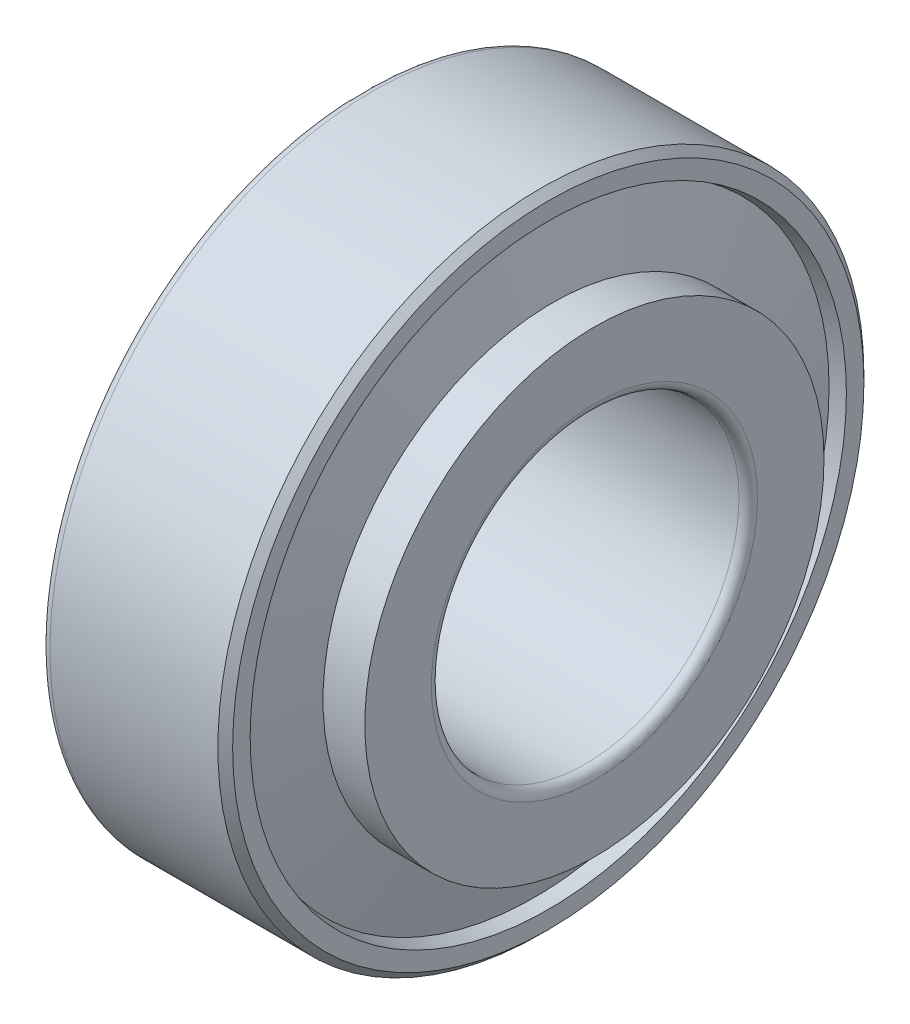
ISO-10303-21;
HEADER;
FILE_DESCRIPTION(('STEP AP214'),'2;1');
FILE_NAME('part.step','',(''),(''),'','','');
FILE_SCHEMA(('AUTOMOTIVE_DESIGN { 1 0 10303 214 1 1 1 1 }'));
ENDSEC;
DATA;
#1=APPLICATION_CONTEXT('core data for automotive mechanical design processes');
#2=APPLICATION_PROTOCOL_DEFINITION('international standard','automotive_design',2000,#1);
#3=PRODUCT_CONTEXT('',#1,'mechanical');
#4=PRODUCT('Part','Part','',(#3));
#5=PRODUCT_RELATED_PRODUCT_CATEGORY('part','',(#4));
#6=PRODUCT_DEFINITION_FORMATION('','',#4);
#7=PRODUCT_DEFINITION_CONTEXT('part definition',#1,'design');
#8=PRODUCT_DEFINITION('design','',#6,#7);
#9=PRODUCT_DEFINITION_SHAPE('','',#8);
#10=(LENGTH_UNIT() NAMED_UNIT(*) SI_UNIT(.MILLI.,.METRE.));
#11=(NAMED_UNIT(*) PLANE_ANGLE_UNIT() SI_UNIT($,.RADIAN.));
#12=(NAMED_UNIT(*) SI_UNIT($,.STERADIAN.) SOLID_ANGLE_UNIT());
#13=UNCERTAINTY_MEASURE_WITH_UNIT(LENGTH_MEASURE(1.E-05),#10,'distance_accuracy_value','');
#14=(GEOMETRIC_REPRESENTATION_CONTEXT(3) GLOBAL_UNCERTAINTY_ASSIGNED_CONTEXT((#13)) GLOBAL_UNIT_ASSIGNED_CONTEXT((#10,
#11,#12)) REPRESENTATION_CONTEXT('',''));
#15=CARTESIAN_POINT('',(0.,0.,0.));
#16=DIRECTION('',(0.,0.,1.));
#17=DIRECTION('',(1.,0.,0.));
#18=AXIS2_PLACEMENT_3D('',#15,#16,#17);
#19=CARTESIAN_POINT('',(-15.,0.,0.));
#20=DIRECTION('',(1.,0.,0.));
#21=DIRECTION('',(0.,0.,-1.));
#22=AXIS2_PLACEMENT_3D('',#19,#20,#21);
#23=CONICAL_SURFACE('',#22,16.3905,0.244346095279201);
#24=CARTESIAN_POINT('',(-14.3805872373067,0.,0.));
#25=DIRECTION('',(-1.,0.,0.));
#26=DIRECTION('',(0.,0.,1.));
#27=AXIS2_PLACEMENT_3D('',#24,#25,#26);
#28=CIRCLE('',#27,16.5449369470579);
#29=CARTESIAN_POINT('',(-14.3805872373067,0.,16.5449369470579));
#30=VERTEX_POINT('',#29);
#31=EDGE_CURVE('E43',#30,#30,#28,.T.);
#32=ORIENTED_EDGE('',*,*,#31,.F.);
#33=EDGE_LOOP('',(#32));
#34=FACE_BOUND('',#33,.T.);
#35=CARTESIAN_POINT('',(-15.,0.,0.));
#36=DIRECTION('',(1.,0.,0.));
#37=DIRECTION('',(0.,0.,-1.));
#38=AXIS2_PLACEMENT_3D('',#35,#36,#37);
#39=CIRCLE('',#38,16.3905);
#40=CARTESIAN_POINT('',(-15.,0.,-16.3905));
#41=VERTEX_POINT('',#40);
#42=EDGE_CURVE('E55',#41,#41,#39,.T.);
#43=ORIENTED_EDGE('',*,*,#42,.F.);
#44=EDGE_LOOP('',(#43));
#45=FACE_BOUND('',#44,.T.);
#46=ADVANCED_FACE('F32',(#34,#45),#23,.F.);
#47=CARTESIAN_POINT('',(-2.99999999999999,20.52,0.));
#48=DIRECTION('',(1.,0.,0.));
#49=DIRECTION('',(0.,0.,-1.));
#50=AXIS2_PLACEMENT_3D('',#47,#48,#49);
#51=PLANE('',#50);
#52=CARTESIAN_POINT('',(-3.,0.,0.));
#53=DIRECTION('',(1.,0.,0.));
#54=DIRECTION('',(0.,0.,-1.));
#55=AXIS2_PLACEMENT_3D('',#52,#53,#54);
#56=CIRCLE('',#55,20.52);
#57=CARTESIAN_POINT('',(-3.,0.,-20.52));
#58=VERTEX_POINT('',#57);
#59=EDGE_CURVE('E67',#58,#58,#56,.T.);
#60=ORIENTED_EDGE('',*,*,#59,.T.);
#61=EDGE_LOOP('',(#60));
#62=FACE_BOUND('',#61,.T.);
#63=CARTESIAN_POINT('',(-3.,0.,0.));
#64=DIRECTION('',(1.,0.,0.));
#65=DIRECTION('',(0.,0.,-1.));
#66=AXIS2_PLACEMENT_3D('',#63,#64,#65);
#67=CIRCLE('',#66,19.3824360341181);
#68=CARTESIAN_POINT('',(-3.,0.,-19.3824360341181));
#69=VERTEX_POINT('',#68);
#70=EDGE_CURVE('E52',#69,#69,#67,.T.);
#71=ORIENTED_EDGE('',*,*,#70,.F.);
#72=EDGE_LOOP('',(#71));
#73=FACE_BOUND('',#72,.T.);
#74=ADVANCED_FACE('F34',(#62,#73),#51,.T.);
#75=CARTESIAN_POINT('',(-3.90139339352587,0.,0.));
#76=DIRECTION('',(-1.,0.,0.));
#77=DIRECTION('',(0.,0.,1.));
#78=AXIS2_PLACEMENT_3D('',#75,#76,#77);
#79=CIRCLE('',#78,19.1576934195343);
#80=CARTESIAN_POINT('',(-3.90139339352587,0.,19.1576934195343));
#81=VERTEX_POINT('',#80);
#82=EDGE_CURVE('E47',#81,#81,#79,.F.);
#83=ORIENTED_EDGE('',*,*,#82,.F.);
#84=EDGE_LOOP('',(#83));
#85=FACE_BOUND('',#84,.T.);
#86=ORIENTED_EDGE('',*,*,#70,.T.);
#87=EDGE_LOOP('',(#86));
#88=FACE_BOUND('',#87,.T.);
#89=ADVANCED_FACE('F120',(#85,#88),#23,.F.);
#90=CARTESIAN_POINT('',(-15.,16.3905,0.));
#91=DIRECTION('',(-1.,0.,0.));
#92=DIRECTION('',(0.,0.,1.));
#93=AXIS2_PLACEMENT_3D('',#90,#91,#92);
#94=PLANE('',#93);
#95=ORIENTED_EDGE('',*,*,#42,.T.);
#96=EDGE_LOOP('',(#95));
#97=FACE_BOUND('',#96,.T.);
#98=CARTESIAN_POINT('',(-15.,0.,0.));
#99=DIRECTION('',(1.,0.,0.));
#100=DIRECTION('',(0.,0.,-1.));
#101=AXIS2_PLACEMENT_3D('',#98,#99,#100);
#102=CIRCLE('',#101,20.4);
#103=CARTESIAN_POINT('',(-15.,0.,-20.4));
#104=VERTEX_POINT('',#103);
#105=EDGE_CURVE('E58',#104,#104,#102,.T.);
#106=ORIENTED_EDGE('',*,*,#105,.F.);
#107=EDGE_LOOP('',(#106));
#108=FACE_BOUND('',#107,.T.);
#109=ADVANCED_FACE('F129',(#97,#108),#94,.T.);
#110=CARTESIAN_POINT('',(-14.4,0.,0.));
#111=DIRECTION('',(1.,0.,0.));
#112=DIRECTION('',(0.,0.,-1.));
#113=AXIS2_PLACEMENT_3D('',#110,#111,#112);
#114=TOROIDAL_SURFACE('',#113,20.4,0.600000000000002);
#115=ORIENTED_EDGE('',*,*,#105,.T.);
#116=EDGE_LOOP('',(#115));
#117=FACE_BOUND('',#116,.T.);
#118=CARTESIAN_POINT('',(-14.4,0.,0.));
#119=DIRECTION('',(1.,0.,0.));
#120=DIRECTION('',(0.,0.,-1.));
#121=AXIS2_PLACEMENT_3D('',#118,#119,#120);
#122=CIRCLE('',#121,21.);
#123=CARTESIAN_POINT('',(-14.4,0.,-21.));
#124=VERTEX_POINT('',#123);
#125=EDGE_CURVE('E61',#124,#124,#122,.T.);
#126=ORIENTED_EDGE('',*,*,#125,.F.);
#127=EDGE_LOOP('',(#126));
#128=FACE_BOUND('',#127,.T.);
#129=ADVANCED_FACE('F134',(#117,#128),#114,.T.);
#130=CARTESIAN_POINT('',(-42.5,0.,0.));
#131=DIRECTION('',(1.,0.,0.));
#132=DIRECTION('',(0.,0.,-1.));
#133=AXIS2_PLACEMENT_3D('',#130,#131,#132);
#134=CYLINDRICAL_SURFACE('',#133,21.);
#135=ORIENTED_EDGE('',*,*,#125,.T.);
#136=EDGE_LOOP('',(#135));
#137=FACE_BOUND('',#136,.T.);
#138=CARTESIAN_POINT('',(-3.48,0.,0.));
#139=DIRECTION('',(1.,0.,0.));
#140=DIRECTION('',(0.,0.,-1.));
#141=AXIS2_PLACEMENT_3D('',#138,#139,#140);
#142=CIRCLE('',#141,21.);
#143=CARTESIAN_POINT('',(-3.48,0.,-21.));
#144=VERTEX_POINT('',#143);
#145=EDGE_CURVE('E64',#144,#144,#142,.T.);
#146=ORIENTED_EDGE('',*,*,#145,.F.);
#147=EDGE_LOOP('',(#146));
#148=FACE_BOUND('',#147,.T.);
#149=ADVANCED_FACE('F156',(#137,#148),#134,.T.);
#150=CARTESIAN_POINT('',(-3.,0.,0.));
#151=DIRECTION('',(-1.,0.,0.));
#152=DIRECTION('',(0.,0.,1.));
#153=AXIS2_PLACEMENT_3D('',#150,#151,#152);
#154=CONICAL_SURFACE('',#153,20.52,0.785398163397445);
#155=ORIENTED_EDGE('',*,*,#145,.T.);
#156=EDGE_LOOP('',(#155));
#157=FACE_BOUND('',#156,.T.);
#158=ORIENTED_EDGE('',*,*,#59,.F.);
#159=EDGE_LOOP('',(#158));
#160=FACE_BOUND('',#159,.T.);
#161=ADVANCED_FACE('F150',(#157,#160),#154,.T.);
#162=CARTESIAN_POINT('',(-14.4,0.,0.));
#163=DIRECTION('',(-1.,0.,0.));
#164=DIRECTION('',(0.,0.,1.));
#165=AXIS2_PLACEMENT_3D('',#162,#163,#164);
#166=CONICAL_SURFACE('',#165,16.6227972855356,1.3264502315157);
#167=CARTESIAN_POINT('',(-13.264195297402,0.,0.));
#168=DIRECTION('',(-1.,0.,0.));
#169=DIRECTION('',(0.,0.,1.));
#170=AXIS2_PLACEMENT_3D('',#167,#168,#169);
#171=CIRCLE('',#170,12.0673334401351);
#172=CARTESIAN_POINT('',(-13.264195297402,0.,12.0673334401351));
#173=VERTEX_POINT('',#172);
#174=EDGE_CURVE('E10',#173,#173,#171,.T.);
#175=ORIENTED_EDGE('',*,*,#174,.F.);
#176=EDGE_LOOP('',(#175));
#177=FACE_BOUND('',#176,.T.);
#178=ORIENTED_EDGE('',*,*,#31,.T.);
#179=EDGE_LOOP('',(#178));
#180=FACE_BOUND('',#179,.T.);
#181=ADVANCED_FACE('F144',(#177,#180),#166,.F.);
#182=CARTESIAN_POINT('',(-13.2024866167817,0.,0.));
#183=DIRECTION('',(1.,0.,0.));
#184=DIRECTION('',(0.,0.,-1.));
#185=AXIS2_PLACEMENT_3D('',#182,#183,#184);
#186=CONICAL_SURFACE('',#185,11.8198334404694,0.2443460952792);
#187=CARTESIAN_POINT('',(-13.1968494807731,0.,0.));
#188=DIRECTION('',(-1.,0.,0.));
#189=DIRECTION('',(0.,0.,1.));
#190=AXIS2_PLACEMENT_3D('',#187,#188,#189);
#191=CIRCLE('',#190,11.8212389363322);
#192=CARTESIAN_POINT('',(-13.1968494807731,0.,11.8212389363322));
#193=VERTEX_POINT('',#192);
#194=EDGE_CURVE('E39',#193,#193,#191,.F.);
#195=ORIENTED_EDGE('',*,*,#194,.F.);
#196=EDGE_LOOP('',(#195));
#197=FACE_BOUND('',#196,.T.);
#198=CARTESIAN_POINT('',(-2.72329277300091,0.,0.));
#199=DIRECTION('',(1.,0.,0.));
#200=DIRECTION('',(0.,0.,-1.));
#201=AXIS2_PLACEMENT_3D('',#198,#199,#200);
#202=CIRCLE('',#201,14.4325899129458);
#203=CARTESIAN_POINT('',(-2.72329277300091,0.,-14.4325899129458));
#204=VERTEX_POINT('',#203);
#205=EDGE_CURVE('E70',#204,#204,#202,.T.);
#206=ORIENTED_EDGE('',*,*,#205,.T.);
#207=EDGE_LOOP('',(#206));
#208=FACE_BOUND('',#207,.T.);
#209=ADVANCED_FACE('F115',(#197,#208),#186,.F.);
#210=CARTESIAN_POINT('',(-2.72329277300091,0.,0.));
#211=DIRECTION('',(-1.,0.,0.));
#212=DIRECTION('',(0.,0.,1.));
#213=AXIS2_PLACEMENT_3D('',#210,#211,#212);
#214=CONICAL_SURFACE('',#213,14.4325899129458,1.3264502315157);
#215=ORIENTED_EDGE('',*,*,#82,.T.);
#216=EDGE_LOOP('',(#215));
#217=FACE_BOUND('',#216,.T.);
#218=ORIENTED_EDGE('',*,*,#205,.F.);
#219=EDGE_LOOP('',(#218));
#220=FACE_BOUND('',#219,.T.);
#221=ADVANCED_FACE('F107',(#217,#220),#214,.T.);
#222=CARTESIAN_POINT('',(-13.1964990512133,0.,0.));
#223=DIRECTION('',(-1.,0.,0.));
#224=DIRECTION('',(0.,0.,1.));
#225=AXIS2_PLACEMENT_3D('',#222,#223,#224);
#226=CONICAL_SURFACE('',#225,11.8198334401351,1.32645023151571);
#227=ORIENTED_EDGE('',*,*,#194,.T.);
#228=EDGE_LOOP('',(#227));
#229=FACE_BOUND('',#228,.T.);
#230=CARTESIAN_POINT('',(-13.1964990512133,0.,0.));
#231=DIRECTION('',(1.,0.,0.));
#232=DIRECTION('',(0.,0.,-1.));
#233=AXIS2_PLACEMENT_3D('',#230,#231,#232);
#234=CIRCLE('',#233,11.8198334401351);
#235=CARTESIAN_POINT('',(-13.1964990512133,0.,-11.8198334401351));
#236=VERTEX_POINT('',#235);
#237=EDGE_CURVE('E97',#236,#236,#234,.T.);
#238=ORIENTED_EDGE('',*,*,#237,.F.);
#239=EDGE_LOOP('',(#238));
#240=FACE_BOUND('',#239,.T.);
#241=ADVANCED_FACE('F104',(#229,#240),#226,.T.);
#242=CARTESIAN_POINT('',(-42.5,0.,0.));
#243=DIRECTION('',(1.,0.,0.));
#244=DIRECTION('',(0.,0.,-1.));
#245=AXIS2_PLACEMENT_3D('',#242,#243,#244);
#246=CYLINDRICAL_SURFACE('',#245,12.0673334401351);
#247=ORIENTED_EDGE('',*,*,#174,.T.);
#248=EDGE_LOOP('',(#247));
#249=FACE_BOUND('',#248,.T.);
#250=CARTESIAN_POINT('',(-15.,0.,0.));
#251=DIRECTION('',(1.,0.,0.));
#252=DIRECTION('',(0.,0.,-1.));
#253=AXIS2_PLACEMENT_3D('',#250,#251,#252);
#254=CIRCLE('',#253,12.0673334401351);
#255=CARTESIAN_POINT('',(-15.,0.,-12.0673334401351));
#256=VERTEX_POINT('',#255);
#257=EDGE_CURVE('E73',#256,#256,#254,.T.);
#258=ORIENTED_EDGE('',*,*,#257,.T.);
#259=EDGE_LOOP('',(#258));
#260=FACE_BOUND('',#259,.T.);
#261=ADVANCED_FACE('F106',(#249,#260),#246,.T.);
#262=CARTESIAN_POINT('',(-15.,12.0673334401351,0.));
#263=DIRECTION('',(-1.,0.,0.));
#264=DIRECTION('',(0.,0.,1.));
#265=AXIS2_PLACEMENT_3D('',#262,#263,#264);
#266=PLANE('',#265);
#267=CARTESIAN_POINT('',(-15.,0.,0.));
#268=DIRECTION('',(1.,0.,0.));
#269=DIRECTION('',(0.,0.,-1.));
#270=AXIS2_PLACEMENT_3D('',#267,#268,#269);
#271=CIRCLE('',#270,10.48);
#272=CARTESIAN_POINT('',(-15.,0.,-10.48));
#273=VERTEX_POINT('',#272);
#274=EDGE_CURVE('E76',#273,#273,#271,.T.);
#275=ORIENTED_EDGE('',*,*,#274,.T.);
#276=EDGE_LOOP('',(#275));
#277=FACE_BOUND('',#276,.T.);
#278=ORIENTED_EDGE('',*,*,#257,.F.);
#279=EDGE_LOOP('',(#278));
#280=FACE_BOUND('',#279,.T.);
#281=ADVANCED_FACE('F113',(#277,#280),#266,.T.);
#282=CARTESIAN_POINT('',(-15.,0.,0.));
#283=DIRECTION('',(-1.,0.,0.));
#284=DIRECTION('',(0.,0.,1.));
#285=AXIS2_PLACEMENT_3D('',#282,#283,#284);
#286=CONICAL_SURFACE('',#285,10.48,0.785398163397455);
#287=CARTESIAN_POINT('',(-14.52,0.,0.));
#288=DIRECTION('',(1.,0.,0.));
#289=DIRECTION('',(0.,0.,-1.));
#290=AXIS2_PLACEMENT_3D('',#287,#288,#289);
#291=CIRCLE('',#290,10.);
#292=CARTESIAN_POINT('',(-14.52,0.,-10.));
#293=VERTEX_POINT('',#292);
#294=EDGE_CURVE('E79',#293,#293,#291,.T.);
#295=ORIENTED_EDGE('',*,*,#294,.T.);
#296=EDGE_LOOP('',(#295));
#297=FACE_BOUND('',#296,.T.);
#298=ORIENTED_EDGE('',*,*,#274,.F.);
#299=EDGE_LOOP('',(#298));
#300=FACE_BOUND('',#299,.T.);
#301=ADVANCED_FACE('F214',(#297,#300),#286,.F.);
#302=CARTESIAN_POINT('',(-42.5,0.,0.));
#303=DIRECTION('',(1.,0.,0.));
#304=DIRECTION('',(0.,0.,-1.));
#305=AXIS2_PLACEMENT_3D('',#302,#303,#304);
#306=CYLINDRICAL_SURFACE('',#305,10.);
#307=CARTESIAN_POINT('',(-0.600000000000003,0.,0.));
#308=DIRECTION('',(1.,0.,0.));
#309=DIRECTION('',(0.,0.,-1.));
#310=AXIS2_PLACEMENT_3D('',#307,#308,#309);
#311=CIRCLE('',#310,10.);
#312=CARTESIAN_POINT('',(-0.600000000000003,0.,-10.));
#313=VERTEX_POINT('',#312);
#314=EDGE_CURVE('E82',#313,#313,#311,.T.);
#315=ORIENTED_EDGE('',*,*,#314,.T.);
#316=EDGE_LOOP('',(#315));
#317=FACE_BOUND('',#316,.T.);
#318=ORIENTED_EDGE('',*,*,#294,.F.);
#319=EDGE_LOOP('',(#318));
#320=FACE_BOUND('',#319,.T.);
#321=ADVANCED_FACE('F224',(#317,#320),#306,.F.);
#322=CARTESIAN_POINT('',(-0.600000000000003,0.,0.));
#323=DIRECTION('',(1.,0.,0.));
#324=DIRECTION('',(0.,0.,-1.));
#325=AXIS2_PLACEMENT_3D('',#322,#323,#324);
#326=TOROIDAL_SURFACE('',#325,10.6,0.6);
#327=CARTESIAN_POINT('',(0.,0.,0.));
#328=DIRECTION('',(1.,0.,0.));
#329=DIRECTION('',(0.,0.,-1.));
#330=AXIS2_PLACEMENT_3D('',#327,#328,#329);
#331=CIRCLE('',#330,10.6);
#332=CARTESIAN_POINT('',(0.,0.,-10.6));
#333=VERTEX_POINT('',#332);
#334=EDGE_CURVE('E85',#333,#333,#331,.T.);
#335=ORIENTED_EDGE('',*,*,#334,.T.);
#336=EDGE_LOOP('',(#335));
#337=FACE_BOUND('',#336,.T.);
#338=ORIENTED_EDGE('',*,*,#314,.F.);
#339=EDGE_LOOP('',(#338));
#340=FACE_BOUND('',#339,.T.);
#341=ADVANCED_FACE('F234',(#337,#340),#326,.T.);
#342=CARTESIAN_POINT('',(0.,10.6,0.));
#343=DIRECTION('',(1.,0.,0.));
#344=DIRECTION('',(0.,0.,-1.));
#345=AXIS2_PLACEMENT_3D('',#342,#343,#344);
#346=PLANE('',#345);
#347=CARTESIAN_POINT('',(0.,0.,0.));
#348=DIRECTION('',(1.,0.,0.));
#349=DIRECTION('',(0.,0.,-1.));
#350=AXIS2_PLACEMENT_3D('',#347,#348,#349);
#351=CIRCLE('',#350,14.9275899126114);
#352=CARTESIAN_POINT('',(0.,0.,-14.9275899126114));
#353=VERTEX_POINT('',#352);
#354=EDGE_CURVE('E88',#353,#353,#351,.T.);
#355=ORIENTED_EDGE('',*,*,#354,.T.);
#356=EDGE_LOOP('',(#355));
#357=FACE_BOUND('',#356,.T.);
#358=ORIENTED_EDGE('',*,*,#334,.F.);
#359=EDGE_LOOP('',(#358));
#360=FACE_BOUND('',#359,.T.);
#361=ADVANCED_FACE('F244',(#357,#360),#346,.T.);
#362=CARTESIAN_POINT('',(-42.5,0.,0.));
#363=DIRECTION('',(1.,0.,0.));
#364=DIRECTION('',(0.,0.,-1.));
#365=AXIS2_PLACEMENT_3D('',#362,#363,#364);
#366=CYLINDRICAL_SURFACE('',#365,14.9275899126114);
#367=CARTESIAN_POINT('',(-2.7173052074325,0.,0.));
#368=DIRECTION('',(1.,0.,0.));
#369=DIRECTION('',(0.,0.,-1.));
#370=AXIS2_PLACEMENT_3D('',#367,#368,#369);
#371=CIRCLE('',#370,14.9275899126114);
#372=CARTESIAN_POINT('',(-2.7173052074325,0.,-14.9275899126114));
#373=VERTEX_POINT('',#372);
#374=EDGE_CURVE('E91',#373,#373,#371,.T.);
#375=ORIENTED_EDGE('',*,*,#374,.T.);
#376=EDGE_LOOP('',(#375));
#377=FACE_BOUND('',#376,.T.);
#378=ORIENTED_EDGE('',*,*,#354,.F.);
#379=EDGE_LOOP('',(#378));
#380=FACE_BOUND('',#379,.T.);
#381=ADVANCED_FACE('F254',(#377,#380),#366,.T.);
#382=CARTESIAN_POINT('',(-2.71730520743249,14.9275899126114,0.));
#383=DIRECTION('',(-1.,0.,0.));
#384=DIRECTION('',(0.,0.,1.));
#385=AXIS2_PLACEMENT_3D('',#382,#383,#384);
#386=PLANE('',#385);
#387=CARTESIAN_POINT('',(-2.7173052074325,0.,0.));
#388=DIRECTION('',(1.,0.,0.));
#389=DIRECTION('',(0.,0.,-1.));
#390=AXIS2_PLACEMENT_3D('',#387,#388,#389);
#391=CIRCLE('',#390,14.4325899126114);
#392=CARTESIAN_POINT('',(-2.7173052074325,0.,-14.4325899126114));
#393=VERTEX_POINT('',#392);
#394=EDGE_CURVE('E94',#393,#393,#391,.T.);
#395=ORIENTED_EDGE('',*,*,#394,.T.);
#396=EDGE_LOOP('',(#395));
#397=FACE_BOUND('',#396,.T.);
#398=ORIENTED_EDGE('',*,*,#374,.F.);
#399=EDGE_LOOP('',(#398));
#400=FACE_BOUND('',#399,.T.);
#401=ADVANCED_FACE('F264',(#397,#400),#386,.T.);
#402=CARTESIAN_POINT('',(-2.7173052074325,0.,0.));
#403=DIRECTION('',(1.,0.,0.));
#404=DIRECTION('',(0.,0.,-1.));
#405=AXIS2_PLACEMENT_3D('',#402,#403,#404);
#406=CONICAL_SURFACE('',#405,14.4325899126114,0.244346095279199);
#407=ORIENTED_EDGE('',*,*,#237,.T.);
#408=EDGE_LOOP('',(#407));
#409=FACE_BOUND('',#408,.T.);
#410=ORIENTED_EDGE('',*,*,#394,.F.);
#411=EDGE_LOOP('',(#410));
#412=FACE_BOUND('',#411,.T.);
#413=ADVANCED_FACE('F101',(#409,#412),#406,.T.);
#414=CLOSED_SHELL('',(#46,#74,#89,#109,#129,#149,#161,#181,#209,#221,#241,#261,#281,#301,#321,
#341,#361,#381,#401,#413));
#415=MANIFOLD_SOLID_BREP('B2',#414);
#416=ADVANCED_BREP_SHAPE_REPRESENTATION('',(#18,#415),#14);
#417=SHAPE_DEFINITION_REPRESENTATION(#9,#416);
ENDSEC;
END-ISO-10303-21;
